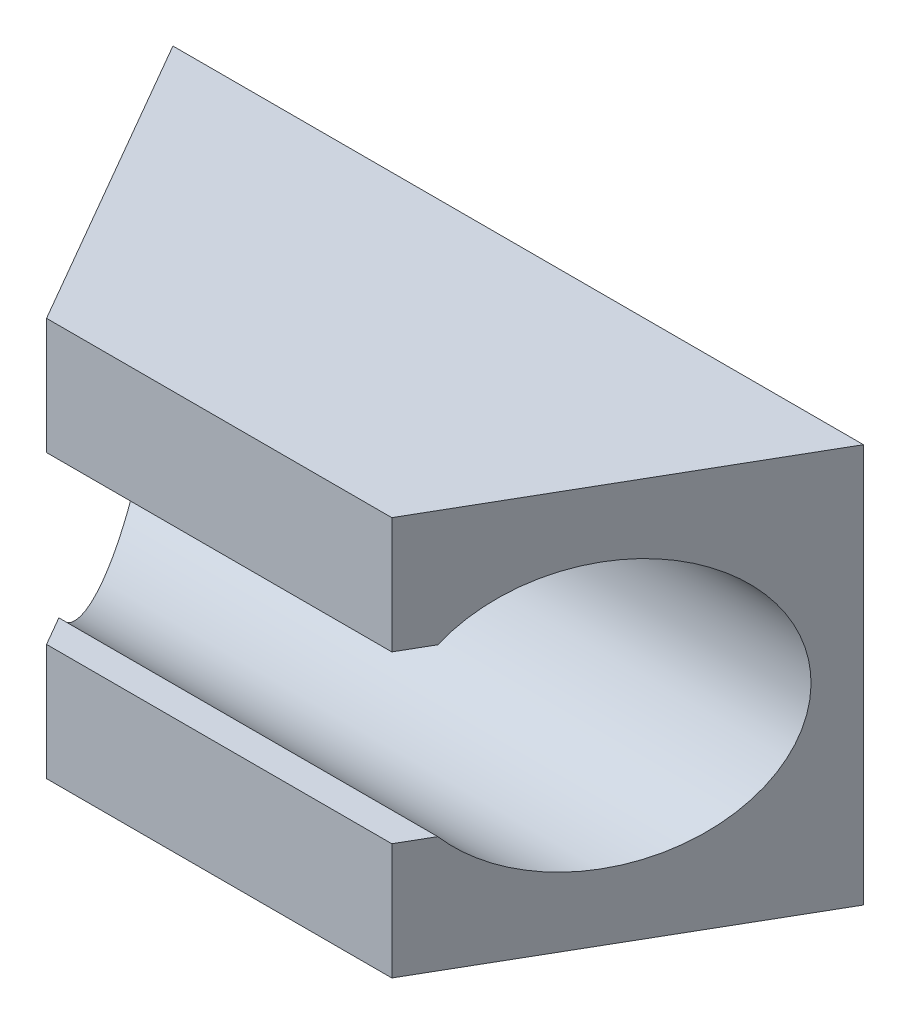
ISO-10303-21;
HEADER;
FILE_DESCRIPTION(('STEP AP214'),'2;1');
FILE_NAME('part.step','',(''),(''),'','','');
FILE_SCHEMA(('AUTOMOTIVE_DESIGN { 1 0 10303 214 1 1 1 1 }'));
ENDSEC;
DATA;
#1=APPLICATION_CONTEXT('core data for automotive mechanical design processes');
#2=APPLICATION_PROTOCOL_DEFINITION('international standard','automotive_design',2000,#1);
#3=PRODUCT_CONTEXT('',#1,'mechanical');
#4=PRODUCT('Part','Part','',(#3));
#5=PRODUCT_RELATED_PRODUCT_CATEGORY('part','',(#4));
#6=PRODUCT_DEFINITION_FORMATION('','',#4);
#7=PRODUCT_DEFINITION_CONTEXT('part definition',#1,'design');
#8=PRODUCT_DEFINITION('design','',#6,#7);
#9=PRODUCT_DEFINITION_SHAPE('','',#8);
#10=(LENGTH_UNIT() NAMED_UNIT(*) SI_UNIT(.MILLI.,.METRE.));
#11=(NAMED_UNIT(*) PLANE_ANGLE_UNIT() SI_UNIT($,.RADIAN.));
#12=(NAMED_UNIT(*) SI_UNIT($,.STERADIAN.) SOLID_ANGLE_UNIT());
#13=UNCERTAINTY_MEASURE_WITH_UNIT(LENGTH_MEASURE(1.E-05),#10,'distance_accuracy_value','');
#14=(GEOMETRIC_REPRESENTATION_CONTEXT(3) GLOBAL_UNCERTAINTY_ASSIGNED_CONTEXT((#13)) GLOBAL_UNIT_ASSIGNED_CONTEXT((#10,
#11,#12)) REPRESENTATION_CONTEXT('',''));
#15=CARTESIAN_POINT('',(0.,0.,0.));
#16=DIRECTION('',(0.,0.,1.));
#17=DIRECTION('',(1.,0.,0.));
#18=AXIS2_PLACEMENT_3D('',#15,#16,#17);
#19=CARTESIAN_POINT('',(0.,0.,4.5));
#20=DIRECTION('',(0.,0.,1.));
#21=DIRECTION('',(1.,0.,0.));
#22=AXIS2_PLACEMENT_3D('',#19,#20,#21);
#23=PLANE('',#22);
#24=DIRECTION('',(0.,-1.,0.));
#25=VECTOR('',#24,1.);
#26=CARTESIAN_POINT('',(-2.59807621135328,3.,4.5));
#27=LINE('',#26,#25);
#28=CARTESIAN_POINT('',(-2.59807621135328,-1.25,4.5));
#29=VERTEX_POINT('',#28);
#30=CARTESIAN_POINT('',(-2.59807621135328,-3.,4.5));
#31=VERTEX_POINT('',#30);
#32=EDGE_CURVE('E106',#29,#31,#27,.T.);
#33=ORIENTED_EDGE('',*,*,#32,.T.);
#34=DIRECTION('',(1.,0.,0.));
#35=VECTOR('',#34,1.);
#36=CARTESIAN_POINT('',(5.19615242270663,-3.,4.5));
#37=LINE('',#36,#35);
#38=CARTESIAN_POINT('',(2.59807621135328,-3.,4.5));
#39=VERTEX_POINT('',#38);
#40=EDGE_CURVE('E126',#31,#39,#37,.T.);
#41=ORIENTED_EDGE('',*,*,#40,.T.);
#42=DIRECTION('',(0.,-1.,0.));
#43=VECTOR('',#42,1.);
#44=CARTESIAN_POINT('',(2.59807621135328,3.,4.5));
#45=LINE('',#44,#43);
#46=CARTESIAN_POINT('',(2.59807621135328,-1.25,4.5));
#47=VERTEX_POINT('',#46);
#48=EDGE_CURVE('E157',#47,#39,#45,.T.);
#49=ORIENTED_EDGE('',*,*,#48,.F.);
#50=DIRECTION('',(1.,0.,0.));
#51=VECTOR('',#50,1.);
#52=CARTESIAN_POINT('',(-5.19615242270663,-1.25,4.5));
#53=LINE('',#52,#51);
#54=EDGE_CURVE('E139',#29,#47,#53,.T.);
#55=ORIENTED_EDGE('',*,*,#54,.F.);
#56=EDGE_LOOP('',(#33,#41,#49,#55));
#57=FACE_BOUND('',#56,.T.);
#58=ADVANCED_FACE('F32',(#57),#23,.T.);
#59=CARTESIAN_POINT('',(5.19615242270663,3.,4.5));
#60=DIRECTION('',(0.,-1.,0.));
#61=DIRECTION('',(0.,0.,-1.));
#62=AXIS2_PLACEMENT_3D('',#59,#60,#61);
#63=PLANE('',#62);
#64=DIRECTION('',(-1.,0.,0.));
#65=VECTOR('',#64,1.);
#66=CARTESIAN_POINT('',(5.19615242270663,3.,0.));
#67=LINE('',#66,#65);
#68=CARTESIAN_POINT('',(5.19615242270663,3.,0.));
#69=VERTEX_POINT('',#68);
#70=CARTESIAN_POINT('',(-5.19615242270663,3.,0.));
#71=VERTEX_POINT('',#70);
#72=EDGE_CURVE('E111',#69,#71,#67,.T.);
#73=ORIENTED_EDGE('',*,*,#72,.T.);
#74=DIRECTION('',(0.500000000000005,0.,0.866025403784436));
#75=VECTOR('',#74,1.);
#76=CARTESIAN_POINT('',(-5.19615242270663,3.,0.));
#77=LINE('',#76,#75);
#78=CARTESIAN_POINT('',(-2.59807621135328,3.,4.5));
#79=VERTEX_POINT('',#78);
#80=EDGE_CURVE('E96',#71,#79,#77,.T.);
#81=ORIENTED_EDGE('',*,*,#80,.T.);
#82=DIRECTION('',(-1.,0.,0.));
#83=VECTOR('',#82,1.);
#84=CARTESIAN_POINT('',(5.19615242270663,3.,4.5));
#85=LINE('',#84,#83);
#86=CARTESIAN_POINT('',(2.59807621135328,3.,4.5));
#87=VERTEX_POINT('',#86);
#88=EDGE_CURVE('E122',#87,#79,#85,.T.);
#89=ORIENTED_EDGE('',*,*,#88,.F.);
#90=DIRECTION('',(0.500000000000005,0.,-0.866025403784436));
#91=VECTOR('',#90,1.);
#92=CARTESIAN_POINT('',(5.19615242270663,3.,0.));
#93=LINE('',#92,#91);
#94=EDGE_CURVE('E112',#87,#69,#93,.T.);
#95=ORIENTED_EDGE('',*,*,#94,.T.);
#96=EDGE_LOOP('',(#73,#81,#89,#95));
#97=FACE_BOUND('',#96,.T.);
#98=ADVANCED_FACE('F34',(#97),#63,.F.);
#99=CARTESIAN_POINT('',(5.19615242270663,-3.,4.5));
#100=DIRECTION('',(0.,1.,0.));
#101=DIRECTION('',(0.,0.,1.));
#102=AXIS2_PLACEMENT_3D('',#99,#100,#101);
#103=PLANE('',#102);
#104=ORIENTED_EDGE('',*,*,#40,.F.);
#105=DIRECTION('',(0.500000000000005,0.,0.866025403784436));
#106=VECTOR('',#105,1.);
#107=CARTESIAN_POINT('',(-5.19615242270663,-3.,0.));
#108=LINE('',#107,#106);
#109=CARTESIAN_POINT('',(-5.19615242270663,-3.,0.));
#110=VERTEX_POINT('',#109);
#111=EDGE_CURVE('E107',#110,#31,#108,.T.);
#112=ORIENTED_EDGE('',*,*,#111,.F.);
#113=DIRECTION('',(1.,0.,0.));
#114=VECTOR('',#113,1.);
#115=CARTESIAN_POINT('',(5.19615242270663,-3.,0.));
#116=LINE('',#115,#114);
#117=CARTESIAN_POINT('',(5.19615242270663,-3.,0.));
#118=VERTEX_POINT('',#117);
#119=EDGE_CURVE('E120',#110,#118,#116,.T.);
#120=ORIENTED_EDGE('',*,*,#119,.T.);
#121=DIRECTION('',(0.500000000000005,0.,-0.866025403784436));
#122=VECTOR('',#121,1.);
#123=CARTESIAN_POINT('',(5.19615242270663,-3.,0.));
#124=LINE('',#123,#122);
#125=EDGE_CURVE('E160',#39,#118,#124,.T.);
#126=ORIENTED_EDGE('',*,*,#125,.F.);
#127=EDGE_LOOP('',(#104,#112,#120,#126));
#128=FACE_BOUND('',#127,.T.);
#129=ADVANCED_FACE('F171',(#128),#103,.F.);
#130=CARTESIAN_POINT('',(-2.59807621135328,1.25,4.5));
#131=VERTEX_POINT('',#130);
#132=EDGE_CURVE('E102',#79,#131,#27,.T.);
#133=ORIENTED_EDGE('',*,*,#132,.T.);
#134=DIRECTION('',(1.,0.,0.));
#135=VECTOR('',#134,1.);
#136=CARTESIAN_POINT('',(-5.19615242270663,1.25,4.5));
#137=LINE('',#136,#135);
#138=CARTESIAN_POINT('',(2.59807621135328,1.25,4.5));
#139=VERTEX_POINT('',#138);
#140=EDGE_CURVE('E54',#131,#139,#137,.T.);
#141=ORIENTED_EDGE('',*,*,#140,.T.);
#142=EDGE_CURVE('E156',#87,#139,#45,.T.);
#143=ORIENTED_EDGE('',*,*,#142,.F.);
#144=ORIENTED_EDGE('',*,*,#88,.T.);
#145=EDGE_LOOP('',(#133,#141,#143,#144));
#146=FACE_BOUND('',#145,.T.);
#147=ADVANCED_FACE('F173',(#146),#23,.T.);
#148=CARTESIAN_POINT('',(0.,0.,0.));
#149=DIRECTION('',(0.,0.,1.));
#150=DIRECTION('',(1.,0.,0.));
#151=AXIS2_PLACEMENT_3D('',#148,#149,#150);
#152=PLANE('',#151);
#153=DIRECTION('',(0.,1.,0.));
#154=VECTOR('',#153,1.);
#155=CARTESIAN_POINT('',(5.19615242270663,-3.,0.));
#156=LINE('',#155,#154);
#157=EDGE_CURVE('E115',#118,#69,#156,.T.);
#158=ORIENTED_EDGE('',*,*,#157,.F.);
#159=ORIENTED_EDGE('',*,*,#119,.F.);
#160=DIRECTION('',(0.,-1.,0.));
#161=VECTOR('',#160,1.);
#162=CARTESIAN_POINT('',(-5.19615242270663,-3.,0.));
#163=LINE('',#162,#161);
#164=EDGE_CURVE('E100',#71,#110,#163,.T.);
#165=ORIENTED_EDGE('',*,*,#164,.F.);
#166=ORIENTED_EDGE('',*,*,#72,.F.);
#167=EDGE_LOOP('',(#158,#159,#165,#166));
#168=FACE_BOUND('',#167,.T.);
#169=ADVANCED_FACE('F118',(#168),#152,.F.);
#170=CARTESIAN_POINT('',(-5.19615242270663,0.,2.5));
#171=DIRECTION('',(1.,0.,0.));
#172=DIRECTION('',(0.,0.,-1.));
#173=AXIS2_PLACEMENT_3D('',#170,#171,#172);
#174=CYLINDRICAL_SURFACE('',#173,2.);
#175=DIRECTION('',(1.,0.,0.));
#176=VECTOR('',#175,1.);
#177=CARTESIAN_POINT('',(-5.19615242270663,1.25,4.0612494995996));
#178=LINE('',#177,#176);
#179=CARTESIAN_POINT('',(-2.85138893086654,1.25,4.0612494995996));
#180=VERTEX_POINT('',#179);
#181=CARTESIAN_POINT('',(2.85138893086654,1.25,4.0612494995996));
#182=VERTEX_POINT('',#181);
#183=EDGE_CURVE('E150',#180,#182,#178,.T.);
#184=ORIENTED_EDGE('',*,*,#183,.F.);
#185=CARTESIAN_POINT('',(-3.75277674973255,0.,2.5));
#186=DIRECTION('',(0.866025403784436,0.,-0.500000000000005));
#187=DIRECTION('',(0.500000000000005,0.,0.866025403784436));
#188=AXIS2_PLACEMENT_3D('',#185,#186,#187);
#189=ELLIPSE('',#188,2.30940107675851,2.);
#190=CARTESIAN_POINT('',(-2.85138893086654,-1.25,4.0612494995996));
#191=VERTEX_POINT('',#190);
#192=EDGE_CURVE('E47',#180,#191,#189,.F.);
#193=ORIENTED_EDGE('',*,*,#192,.T.);
#194=DIRECTION('',(1.,0.,0.));
#195=VECTOR('',#194,1.);
#196=CARTESIAN_POINT('',(-5.19615242270663,-1.25,4.0612494995996));
#197=LINE('',#196,#195);
#198=CARTESIAN_POINT('',(2.85138893086654,-1.25,4.0612494995996));
#199=VERTEX_POINT('',#198);
#200=EDGE_CURVE('E137',#191,#199,#197,.T.);
#201=ORIENTED_EDGE('',*,*,#200,.T.);
#202=CARTESIAN_POINT('',(3.75277674973255,0.,2.5));
#203=DIRECTION('',(-0.866025403784436,0.,-0.500000000000005));
#204=DIRECTION('',(0.500000000000005,0.,-0.866025403784436));
#205=AXIS2_PLACEMENT_3D('',#202,#203,#204);
#206=ELLIPSE('',#205,2.30940107675851,2.);
#207=EDGE_CURVE('E153',#199,#182,#206,.F.);
#208=ORIENTED_EDGE('',*,*,#207,.T.);
#209=EDGE_LOOP('',(#184,#193,#201,#208));
#210=FACE_BOUND('',#209,.T.);
#211=ADVANCED_FACE('F175',(#210),#174,.F.);
#212=CARTESIAN_POINT('',(-5.19615242270663,-1.25,4.0612494995996));
#213=DIRECTION('',(0.,-1.,0.));
#214=DIRECTION('',(0.,0.,-1.));
#215=AXIS2_PLACEMENT_3D('',#212,#213,#214);
#216=PLANE('',#215);
#217=ORIENTED_EDGE('',*,*,#200,.F.);
#218=DIRECTION('',(0.500000000000005,0.,0.866025403784436));
#219=VECTOR('',#218,1.);
#220=CARTESIAN_POINT('',(-3.43757980382657,-1.25,3.04593712469968));
#221=LINE('',#220,#219);
#222=EDGE_CURVE('E162',#191,#29,#221,.T.);
#223=ORIENTED_EDGE('',*,*,#222,.T.);
#224=ORIENTED_EDGE('',*,*,#54,.T.);
#225=DIRECTION('',(0.500000000000005,0.,-0.866025403784436));
#226=VECTOR('',#225,1.);
#227=CARTESIAN_POINT('',(0.839503592473208,-1.25,7.54593712469971));
#228=LINE('',#227,#226);
#229=EDGE_CURVE('E147',#47,#199,#228,.T.);
#230=ORIENTED_EDGE('',*,*,#229,.T.);
#231=EDGE_LOOP('',(#217,#223,#224,#230));
#232=FACE_BOUND('',#231,.T.);
#233=ADVANCED_FACE('F176',(#232),#216,.F.);
#234=CARTESIAN_POINT('',(-5.19615242270663,1.25,4.0612494995996));
#235=DIRECTION('',(0.,1.,0.));
#236=DIRECTION('',(0.,0.,1.));
#237=AXIS2_PLACEMENT_3D('',#234,#235,#236);
#238=PLANE('',#237);
#239=ORIENTED_EDGE('',*,*,#140,.F.);
#240=DIRECTION('',(-0.500000000000005,0.,-0.866025403784436));
#241=VECTOR('',#240,1.);
#242=CARTESIAN_POINT('',(-3.43757980382657,1.25,3.04593712469968));
#243=LINE('',#242,#241);
#244=EDGE_CURVE('E11',#131,#180,#243,.T.);
#245=ORIENTED_EDGE('',*,*,#244,.T.);
#246=ORIENTED_EDGE('',*,*,#183,.T.);
#247=DIRECTION('',(-0.500000000000005,0.,0.866025403784436));
#248=VECTOR('',#247,1.);
#249=CARTESIAN_POINT('',(0.839503592473208,1.25,7.54593712469971));
#250=LINE('',#249,#248);
#251=EDGE_CURVE('E40',#182,#139,#250,.T.);
#252=ORIENTED_EDGE('',*,*,#251,.T.);
#253=EDGE_LOOP('',(#239,#245,#246,#252));
#254=FACE_BOUND('',#253,.T.);
#255=ADVANCED_FACE('F174',(#254),#238,.F.);
#256=CARTESIAN_POINT('',(5.19615242270663,3.,0.));
#257=DIRECTION('',(-0.866025403784436,0.,-0.500000000000005));
#258=DIRECTION('',(-0.500000000000005,0.,0.866025403784436));
#259=AXIS2_PLACEMENT_3D('',#256,#257,#258);
#260=PLANE('',#259);
#261=ORIENTED_EDGE('',*,*,#48,.T.);
#262=ORIENTED_EDGE('',*,*,#125,.T.);
#263=ORIENTED_EDGE('',*,*,#157,.T.);
#264=ORIENTED_EDGE('',*,*,#94,.F.);
#265=ORIENTED_EDGE('',*,*,#142,.T.);
#266=ORIENTED_EDGE('',*,*,#251,.F.);
#267=ORIENTED_EDGE('',*,*,#207,.F.);
#268=ORIENTED_EDGE('',*,*,#229,.F.);
#269=EDGE_LOOP('',(#261,#262,#263,#264,#265,#266,#267,#268));
#270=FACE_BOUND('',#269,.T.);
#271=ADVANCED_FACE('F172',(#270),#260,.F.);
#272=CARTESIAN_POINT('',(-5.19615242270663,3.,0.));
#273=DIRECTION('',(0.866025403784436,0.,-0.500000000000005));
#274=DIRECTION('',(-0.500000000000005,0.,-0.866025403784436));
#275=AXIS2_PLACEMENT_3D('',#272,#273,#274);
#276=PLANE('',#275);
#277=ORIENTED_EDGE('',*,*,#192,.F.);
#278=ORIENTED_EDGE('',*,*,#244,.F.);
#279=ORIENTED_EDGE('',*,*,#132,.F.);
#280=ORIENTED_EDGE('',*,*,#80,.F.);
#281=ORIENTED_EDGE('',*,*,#164,.T.);
#282=ORIENTED_EDGE('',*,*,#111,.T.);
#283=ORIENTED_EDGE('',*,*,#32,.F.);
#284=ORIENTED_EDGE('',*,*,#222,.F.);
#285=EDGE_LOOP('',(#277,#278,#279,#280,#281,#282,#283,#284));
#286=FACE_BOUND('',#285,.T.);
#287=ADVANCED_FACE('F98',(#286),#276,.F.);
#288=CLOSED_SHELL('',(#58,#98,#129,#147,#169,#211,#233,#255,#271,#287));
#289=MANIFOLD_SOLID_BREP('B2',#288);
#290=ADVANCED_BREP_SHAPE_REPRESENTATION('',(#18,#289),#14);
#291=SHAPE_DEFINITION_REPRESENTATION(#9,#290);
ENDSEC;
END-ISO-10303-21;
